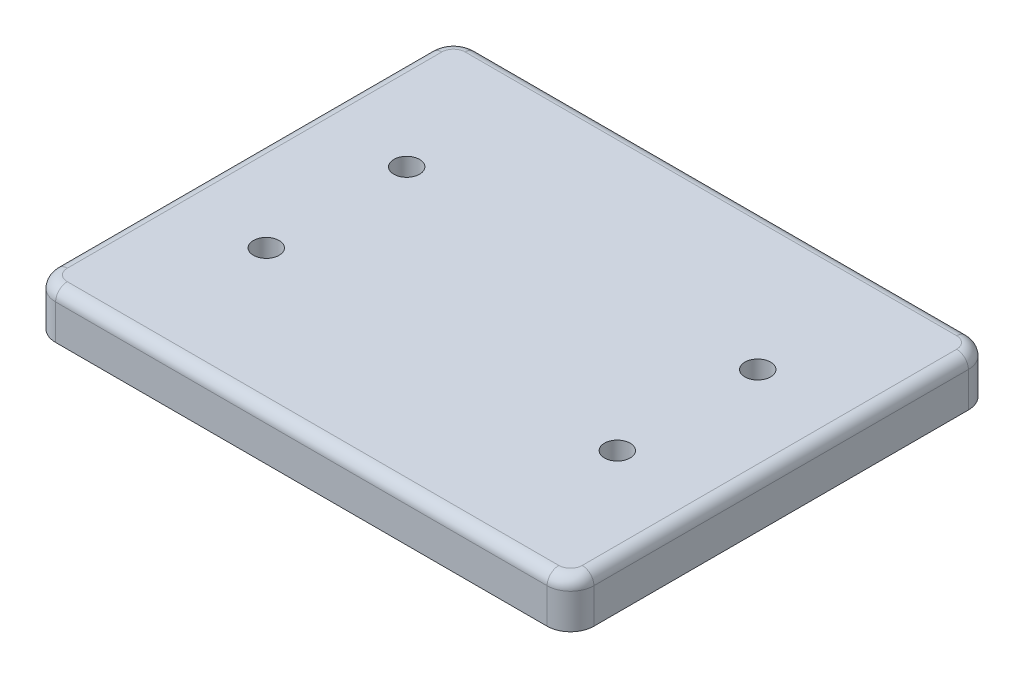
ISO-10303-21;
HEADER;
FILE_DESCRIPTION(('STEP AP214'),'2;1');
FILE_NAME('part.step','',(''),(''),'','','');
FILE_SCHEMA(('AUTOMOTIVE_DESIGN { 1 0 10303 214 1 1 1 1 }'));
ENDSEC;
DATA;
#1=APPLICATION_CONTEXT('core data for automotive mechanical design processes');
#2=APPLICATION_PROTOCOL_DEFINITION('international standard','automotive_design',2000,#1);
#3=PRODUCT_CONTEXT('',#1,'mechanical');
#4=PRODUCT('Part','Part','',(#3));
#5=PRODUCT_RELATED_PRODUCT_CATEGORY('part','',(#4));
#6=PRODUCT_DEFINITION_FORMATION('','',#4);
#7=PRODUCT_DEFINITION_CONTEXT('part definition',#1,'design');
#8=PRODUCT_DEFINITION('design','',#6,#7);
#9=PRODUCT_DEFINITION_SHAPE('','',#8);
#10=(LENGTH_UNIT() NAMED_UNIT(*) SI_UNIT(.MILLI.,.METRE.));
#11=(NAMED_UNIT(*) PLANE_ANGLE_UNIT() SI_UNIT($,.RADIAN.));
#12=(NAMED_UNIT(*) SI_UNIT($,.STERADIAN.) SOLID_ANGLE_UNIT());
#13=UNCERTAINTY_MEASURE_WITH_UNIT(LENGTH_MEASURE(1.E-05),#10,'distance_accuracy_value','');
#14=(GEOMETRIC_REPRESENTATION_CONTEXT(3) GLOBAL_UNCERTAINTY_ASSIGNED_CONTEXT((#13)) GLOBAL_UNIT_ASSIGNED_CONTEXT((#10,
#11,#12)) REPRESENTATION_CONTEXT('',''));
#15=CARTESIAN_POINT('',(0.,0.,0.));
#16=DIRECTION('',(0.,0.,1.));
#17=DIRECTION('',(1.,0.,0.));
#18=AXIS2_PLACEMENT_3D('',#15,#16,#17);
#19=CARTESIAN_POINT('',(-150.,40.,-60.));
#20=DIRECTION('',(0.,-1.,0.));
#21=DIRECTION('',(0.,0.,-1.));
#22=AXIS2_PLACEMENT_3D('',#19,#20,#21);
#23=CYLINDRICAL_SURFACE('',#22,11.);
#24=CARTESIAN_POINT('',(-150.,40.,-60.));
#25=DIRECTION('',(0.,1.,0.));
#26=DIRECTION('',(0.,0.,1.));
#27=AXIS2_PLACEMENT_3D('',#24,#25,#26);
#28=CIRCLE('',#27,11.);
#29=CARTESIAN_POINT('',(-150.,40.,-49.));
#30=VERTEX_POINT('',#29);
#31=EDGE_CURVE('E154',#30,#30,#28,.T.);
#32=ORIENTED_EDGE('',*,*,#31,.T.);
#33=EDGE_LOOP('',(#32));
#34=FACE_BOUND('',#33,.T.);
#35=CARTESIAN_POINT('',(-150.,20.,-60.));
#36=DIRECTION('',(0.,-1.,0.));
#37=DIRECTION('',(0.,0.,-1.));
#38=AXIS2_PLACEMENT_3D('',#35,#36,#37);
#39=CIRCLE('',#38,11.);
#40=CARTESIAN_POINT('',(-150.,20.,-71.));
#41=VERTEX_POINT('',#40);
#42=EDGE_CURVE('E42',#41,#41,#39,.T.);
#43=ORIENTED_EDGE('',*,*,#42,.T.);
#44=EDGE_LOOP('',(#43));
#45=FACE_BOUND('',#44,.T.);
#46=ADVANCED_FACE('F38',(#34,#45),#23,.F.);
#47=CARTESIAN_POINT('',(150.,40.,60.));
#48=DIRECTION('',(0.,-1.,0.));
#49=DIRECTION('',(0.,0.,-1.));
#50=AXIS2_PLACEMENT_3D('',#47,#48,#49);
#51=CYLINDRICAL_SURFACE('',#50,11.);
#52=CARTESIAN_POINT('',(150.,40.,60.));
#53=DIRECTION('',(0.,1.,0.));
#54=DIRECTION('',(0.,0.,1.));
#55=AXIS2_PLACEMENT_3D('',#52,#53,#54);
#56=CIRCLE('',#55,11.);
#57=CARTESIAN_POINT('',(150.,40.,71.));
#58=VERTEX_POINT('',#57);
#59=EDGE_CURVE('E264',#58,#58,#56,.T.);
#60=ORIENTED_EDGE('',*,*,#59,.T.);
#61=EDGE_LOOP('',(#60));
#62=FACE_BOUND('',#61,.T.);
#63=CARTESIAN_POINT('',(150.,20.,60.));
#64=DIRECTION('',(0.,-1.,0.));
#65=DIRECTION('',(0.,0.,-1.));
#66=AXIS2_PLACEMENT_3D('',#63,#64,#65);
#67=CIRCLE('',#66,11.);
#68=CARTESIAN_POINT('',(150.,20.,49.));
#69=VERTEX_POINT('',#68);
#70=EDGE_CURVE('E245',#69,#69,#67,.T.);
#71=ORIENTED_EDGE('',*,*,#70,.T.);
#72=EDGE_LOOP('',(#71));
#73=FACE_BOUND('',#72,.T.);
#74=ADVANCED_FACE('F284',(#62,#73),#51,.F.);
#75=CARTESIAN_POINT('',(150.,40.,-60.));
#76=DIRECTION('',(0.,-1.,0.));
#77=DIRECTION('',(0.,0.,-1.));
#78=AXIS2_PLACEMENT_3D('',#75,#76,#77);
#79=CYLINDRICAL_SURFACE('',#78,11.);
#80=CARTESIAN_POINT('',(150.,40.,-60.));
#81=DIRECTION('',(0.,1.,0.));
#82=DIRECTION('',(0.,0.,-1.));
#83=AXIS2_PLACEMENT_3D('',#80,#81,#82);
#84=CIRCLE('',#83,11.);
#85=CARTESIAN_POINT('',(150.,40.,-71.));
#86=VERTEX_POINT('',#85);
#87=EDGE_CURVE('E239',#86,#86,#84,.T.);
#88=ORIENTED_EDGE('',*,*,#87,.T.);
#89=EDGE_LOOP('',(#88));
#90=FACE_BOUND('',#89,.T.);
#91=CARTESIAN_POINT('',(150.,20.,-60.));
#92=DIRECTION('',(0.,-1.,0.));
#93=DIRECTION('',(0.,0.,-1.));
#94=AXIS2_PLACEMENT_3D('',#91,#92,#93);
#95=CIRCLE('',#94,11.);
#96=CARTESIAN_POINT('',(150.,20.,-71.));
#97=VERTEX_POINT('',#96);
#98=EDGE_CURVE('E243',#97,#97,#95,.T.);
#99=ORIENTED_EDGE('',*,*,#98,.T.);
#100=EDGE_LOOP('',(#99));
#101=FACE_BOUND('',#100,.T.);
#102=ADVANCED_FACE('F281',(#90,#101),#79,.F.);
#103=CARTESIAN_POINT('',(-150.,40.,60.));
#104=DIRECTION('',(0.,-1.,0.));
#105=DIRECTION('',(0.,0.,-1.));
#106=AXIS2_PLACEMENT_3D('',#103,#104,#105);
#107=CYLINDRICAL_SURFACE('',#106,11.);
#108=CARTESIAN_POINT('',(-150.,40.,60.));
#109=DIRECTION('',(0.,1.,0.));
#110=DIRECTION('',(0.,0.,-1.));
#111=AXIS2_PLACEMENT_3D('',#108,#109,#110);
#112=CIRCLE('',#111,11.);
#113=CARTESIAN_POINT('',(-150.,40.,49.));
#114=VERTEX_POINT('',#113);
#115=EDGE_CURVE('E157',#114,#114,#112,.T.);
#116=ORIENTED_EDGE('',*,*,#115,.T.);
#117=EDGE_LOOP('',(#116));
#118=FACE_BOUND('',#117,.T.);
#119=CARTESIAN_POINT('',(-150.,20.,60.));
#120=DIRECTION('',(0.,-1.,0.));
#121=DIRECTION('',(0.,0.,-1.));
#122=AXIS2_PLACEMENT_3D('',#119,#120,#121);
#123=CIRCLE('',#122,11.);
#124=CARTESIAN_POINT('',(-150.,20.,49.));
#125=VERTEX_POINT('',#124);
#126=EDGE_CURVE('E219',#125,#125,#123,.T.);
#127=ORIENTED_EDGE('',*,*,#126,.T.);
#128=EDGE_LOOP('',(#127));
#129=FACE_BOUND('',#128,.T.);
#130=ADVANCED_FACE('F269',(#118,#129),#107,.F.);
#131=CARTESIAN_POINT('',(-210.,40.,160.));
#132=DIRECTION('',(0.,-1.,0.));
#133=DIRECTION('',(0.,0.,-1.));
#134=AXIS2_PLACEMENT_3D('',#131,#132,#133);
#135=PLANE('',#134);
#136=DIRECTION('',(0.,0.,1.));
#137=VECTOR('',#136,1.);
#138=CARTESIAN_POINT('',(-220.,40.,160.));
#139=LINE('',#138,#137);
#140=CARTESIAN_POINT('',(-220.,40.,-160.));
#141=VERTEX_POINT('',#140);
#142=CARTESIAN_POINT('',(-220.,40.,160.));
#143=VERTEX_POINT('',#142);
#144=EDGE_CURVE('E199',#141,#143,#139,.T.);
#145=ORIENTED_EDGE('',*,*,#144,.T.);
#146=CARTESIAN_POINT('',(-210.,40.,160.));
#147=DIRECTION('',(0.,-1.,0.));
#148=DIRECTION('',(0.,0.,-1.));
#149=AXIS2_PLACEMENT_3D('',#146,#147,#148);
#150=CIRCLE('',#149,9.99999999999999);
#151=CARTESIAN_POINT('',(-210.,40.,170.));
#152=VERTEX_POINT('',#151);
#153=EDGE_CURVE('E201',#143,#152,#150,.F.);
#154=ORIENTED_EDGE('',*,*,#153,.T.);
#155=DIRECTION('',(1.,0.,0.));
#156=VECTOR('',#155,1.);
#157=CARTESIAN_POINT('',(-210.,40.,170.));
#158=LINE('',#157,#156);
#159=CARTESIAN_POINT('',(210.,40.,170.));
#160=VERTEX_POINT('',#159);
#161=EDGE_CURVE('E138',#152,#160,#158,.T.);
#162=ORIENTED_EDGE('',*,*,#161,.T.);
#163=CARTESIAN_POINT('',(210.,40.,160.));
#164=DIRECTION('',(0.,-1.,0.));
#165=DIRECTION('',(0.,0.,-1.));
#166=AXIS2_PLACEMENT_3D('',#163,#164,#165);
#167=CIRCLE('',#166,9.99999999999999);
#168=CARTESIAN_POINT('',(220.,40.,160.));
#169=VERTEX_POINT('',#168);
#170=EDGE_CURVE('E189',#160,#169,#167,.F.);
#171=ORIENTED_EDGE('',*,*,#170,.T.);
#172=DIRECTION('',(0.,0.,-1.));
#173=VECTOR('',#172,1.);
#174=CARTESIAN_POINT('',(220.,40.,160.));
#175=LINE('',#174,#173);
#176=CARTESIAN_POINT('',(220.,40.,-160.));
#177=VERTEX_POINT('',#176);
#178=EDGE_CURVE('E191',#169,#177,#175,.T.);
#179=ORIENTED_EDGE('',*,*,#178,.T.);
#180=CARTESIAN_POINT('',(210.,40.,-160.));
#181=DIRECTION('',(0.,-1.,0.));
#182=DIRECTION('',(0.,0.,-1.));
#183=AXIS2_PLACEMENT_3D('',#180,#181,#182);
#184=CIRCLE('',#183,9.99999999999999);
#185=CARTESIAN_POINT('',(210.,40.,-170.));
#186=VERTEX_POINT('',#185);
#187=EDGE_CURVE('E193',#177,#186,#184,.F.);
#188=ORIENTED_EDGE('',*,*,#187,.T.);
#189=DIRECTION('',(-1.,0.,0.));
#190=VECTOR('',#189,1.);
#191=CARTESIAN_POINT('',(-210.,40.,-170.));
#192=LINE('',#191,#190);
#193=CARTESIAN_POINT('',(-210.,40.,-170.));
#194=VERTEX_POINT('',#193);
#195=EDGE_CURVE('E195',#186,#194,#192,.T.);
#196=ORIENTED_EDGE('',*,*,#195,.T.);
#197=CARTESIAN_POINT('',(-210.,40.,-160.));
#198=DIRECTION('',(0.,-1.,0.));
#199=DIRECTION('',(0.,0.,-1.));
#200=AXIS2_PLACEMENT_3D('',#197,#198,#199);
#201=CIRCLE('',#200,9.99999999999999);
#202=EDGE_CURVE('E197',#194,#141,#201,.F.);
#203=ORIENTED_EDGE('',*,*,#202,.T.);
#204=EDGE_LOOP('',(#145,#154,#162,#171,#179,#188,#196,#203));
#205=FACE_BOUND('',#204,.T.);
#206=ORIENTED_EDGE('',*,*,#31,.F.);
#207=EDGE_LOOP('',(#206));
#208=FACE_BOUND('',#207,.T.);
#209=ORIENTED_EDGE('',*,*,#115,.F.);
#210=EDGE_LOOP('',(#209));
#211=FACE_BOUND('',#210,.T.);
#212=ORIENTED_EDGE('',*,*,#59,.F.);
#213=EDGE_LOOP('',(#212));
#214=FACE_BOUND('',#213,.T.);
#215=ORIENTED_EDGE('',*,*,#87,.F.);
#216=EDGE_LOOP('',(#215));
#217=FACE_BOUND('',#216,.T.);
#218=ADVANCED_FACE('F272',(#205,#208,#211,#214,#217),#135,.F.);
#219=CARTESIAN_POINT('',(-210.,0.,160.));
#220=DIRECTION('',(0.,-1.,0.));
#221=DIRECTION('',(0.,0.,-1.));
#222=AXIS2_PLACEMENT_3D('',#219,#220,#221);
#223=PLANE('',#222);
#224=CARTESIAN_POINT('',(-150.,0.,-60.));
#225=DIRECTION('',(0.,-1.,0.));
#226=DIRECTION('',(0.,0.,-1.));
#227=AXIS2_PLACEMENT_3D('',#224,#225,#226);
#228=CIRCLE('',#227,18.);
#229=CARTESIAN_POINT('',(-150.,0.,-78.));
#230=VERTEX_POINT('',#229);
#231=EDGE_CURVE('E308',#230,#230,#228,.T.);
#232=ORIENTED_EDGE('',*,*,#231,.F.);
#233=EDGE_LOOP('',(#232));
#234=FACE_BOUND('',#233,.T.);
#235=CARTESIAN_POINT('',(150.,0.,60.));
#236=DIRECTION('',(0.,-1.,0.));
#237=DIRECTION('',(0.,0.,-1.));
#238=AXIS2_PLACEMENT_3D('',#235,#236,#237);
#239=CIRCLE('',#238,18.);
#240=CARTESIAN_POINT('',(150.,0.,42.));
#241=VERTEX_POINT('',#240);
#242=EDGE_CURVE('E298',#241,#241,#239,.T.);
#243=ORIENTED_EDGE('',*,*,#242,.F.);
#244=EDGE_LOOP('',(#243));
#245=FACE_BOUND('',#244,.T.);
#246=CARTESIAN_POINT('',(150.,0.,-60.));
#247=DIRECTION('',(0.,-1.,0.));
#248=DIRECTION('',(0.,0.,-1.));
#249=AXIS2_PLACEMENT_3D('',#246,#247,#248);
#250=CIRCLE('',#249,18.);
#251=CARTESIAN_POINT('',(150.,0.,-78.));
#252=VERTEX_POINT('',#251);
#253=EDGE_CURVE('E299',#252,#252,#250,.T.);
#254=ORIENTED_EDGE('',*,*,#253,.F.);
#255=EDGE_LOOP('',(#254));
#256=FACE_BOUND('',#255,.T.);
#257=CARTESIAN_POINT('',(-150.,0.,60.));
#258=DIRECTION('',(0.,-1.,0.));
#259=DIRECTION('',(0.,0.,-1.));
#260=AXIS2_PLACEMENT_3D('',#257,#258,#259);
#261=CIRCLE('',#260,18.);
#262=CARTESIAN_POINT('',(-150.,0.,42.));
#263=VERTEX_POINT('',#262);
#264=EDGE_CURVE('E251',#263,#263,#261,.T.);
#265=ORIENTED_EDGE('',*,*,#264,.F.);
#266=EDGE_LOOP('',(#265));
#267=FACE_BOUND('',#266,.T.);
#268=CARTESIAN_POINT('',(-210.,0.,160.));
#269=DIRECTION('',(0.,1.,0.));
#270=DIRECTION('',(0.,0.,-1.));
#271=AXIS2_PLACEMENT_3D('',#268,#269,#270);
#272=CIRCLE('',#271,20.);
#273=CARTESIAN_POINT('',(-230.,0.,160.));
#274=VERTEX_POINT('',#273);
#275=CARTESIAN_POINT('',(-210.,0.,180.));
#276=VERTEX_POINT('',#275);
#277=EDGE_CURVE('E145',#274,#276,#272,.T.);
#278=ORIENTED_EDGE('',*,*,#277,.F.);
#279=DIRECTION('',(0.,0.,1.));
#280=VECTOR('',#279,1.);
#281=CARTESIAN_POINT('',(-230.,0.,160.));
#282=LINE('',#281,#280);
#283=CARTESIAN_POINT('',(-230.,0.,-160.));
#284=VERTEX_POINT('',#283);
#285=EDGE_CURVE('E174',#284,#274,#282,.T.);
#286=ORIENTED_EDGE('',*,*,#285,.F.);
#287=CARTESIAN_POINT('',(-210.,0.,-160.));
#288=DIRECTION('',(0.,1.,0.));
#289=DIRECTION('',(0.,0.,-1.));
#290=AXIS2_PLACEMENT_3D('',#287,#288,#289);
#291=CIRCLE('',#290,20.);
#292=CARTESIAN_POINT('',(-210.,0.,-180.));
#293=VERTEX_POINT('',#292);
#294=EDGE_CURVE('E171',#293,#284,#291,.T.);
#295=ORIENTED_EDGE('',*,*,#294,.F.);
#296=DIRECTION('',(-1.,0.,0.));
#297=VECTOR('',#296,1.);
#298=CARTESIAN_POINT('',(-210.,0.,-180.));
#299=LINE('',#298,#297);
#300=CARTESIAN_POINT('',(210.,0.,-180.));
#301=VERTEX_POINT('',#300);
#302=EDGE_CURVE('E168',#301,#293,#299,.T.);
#303=ORIENTED_EDGE('',*,*,#302,.F.);
#304=CARTESIAN_POINT('',(210.,0.,-160.));
#305=DIRECTION('',(0.,1.,0.));
#306=DIRECTION('',(0.,0.,-1.));
#307=AXIS2_PLACEMENT_3D('',#304,#305,#306);
#308=CIRCLE('',#307,20.);
#309=CARTESIAN_POINT('',(230.,0.,-160.));
#310=VERTEX_POINT('',#309);
#311=EDGE_CURVE('E165',#310,#301,#308,.T.);
#312=ORIENTED_EDGE('',*,*,#311,.F.);
#313=DIRECTION('',(0.,0.,-1.));
#314=VECTOR('',#313,1.);
#315=CARTESIAN_POINT('',(230.,0.,160.));
#316=LINE('',#315,#314);
#317=CARTESIAN_POINT('',(230.,0.,160.));
#318=VERTEX_POINT('',#317);
#319=EDGE_CURVE('E162',#318,#310,#316,.T.);
#320=ORIENTED_EDGE('',*,*,#319,.F.);
#321=CARTESIAN_POINT('',(210.,0.,160.));
#322=DIRECTION('',(0.,1.,0.));
#323=DIRECTION('',(0.,0.,1.));
#324=AXIS2_PLACEMENT_3D('',#321,#322,#323);
#325=CIRCLE('',#324,20.);
#326=CARTESIAN_POINT('',(210.,0.,180.));
#327=VERTEX_POINT('',#326);
#328=EDGE_CURVE('E148',#327,#318,#325,.T.);
#329=ORIENTED_EDGE('',*,*,#328,.F.);
#330=DIRECTION('',(1.,0.,0.));
#331=VECTOR('',#330,1.);
#332=CARTESIAN_POINT('',(-210.,0.,180.));
#333=LINE('',#332,#331);
#334=EDGE_CURVE('E131',#276,#327,#333,.T.);
#335=ORIENTED_EDGE('',*,*,#334,.F.);
#336=EDGE_LOOP('',(#278,#286,#295,#303,#312,#320,#329,#335));
#337=FACE_BOUND('',#336,.T.);
#338=ADVANCED_FACE('F143',(#234,#245,#256,#267,#337),#223,.T.);
#339=CARTESIAN_POINT('',(-210.,40.,160.));
#340=DIRECTION('',(0.,-1.,0.));
#341=DIRECTION('',(0.,0.,-1.));
#342=AXIS2_PLACEMENT_3D('',#339,#340,#341);
#343=CYLINDRICAL_SURFACE('',#342,20.);
#344=DIRECTION('',(0.,-1.,0.));
#345=VECTOR('',#344,1.);
#346=CARTESIAN_POINT('',(-210.,40.,180.));
#347=LINE('',#346,#345);
#348=CARTESIAN_POINT('',(-210.,30.,180.));
#349=VERTEX_POINT('',#348);
#350=EDGE_CURVE('E128',#349,#276,#347,.T.);
#351=ORIENTED_EDGE('',*,*,#350,.F.);
#352=CARTESIAN_POINT('',(-210.,30.,160.));
#353=DIRECTION('',(0.,-1.,0.));
#354=DIRECTION('',(0.,0.,-1.));
#355=AXIS2_PLACEMENT_3D('',#352,#353,#354);
#356=CIRCLE('',#355,20.);
#357=CARTESIAN_POINT('',(-230.,30.,160.));
#358=VERTEX_POINT('',#357);
#359=EDGE_CURVE('E204',#349,#358,#356,.T.);
#360=ORIENTED_EDGE('',*,*,#359,.T.);
#361=DIRECTION('',(0.,-1.,0.));
#362=VECTOR('',#361,1.);
#363=CARTESIAN_POINT('',(-230.,40.,160.));
#364=LINE('',#363,#362);
#365=EDGE_CURVE('E152',#358,#274,#364,.T.);
#366=ORIENTED_EDGE('',*,*,#365,.T.);
#367=ORIENTED_EDGE('',*,*,#277,.T.);
#368=EDGE_LOOP('',(#351,#360,#366,#367));
#369=FACE_BOUND('',#368,.T.);
#370=ADVANCED_FACE('F150',(#369),#343,.T.);
#371=CARTESIAN_POINT('',(-210.,40.,180.));
#372=DIRECTION('',(0.,0.,-1.));
#373=DIRECTION('',(-1.,0.,0.));
#374=AXIS2_PLACEMENT_3D('',#371,#372,#373);
#375=PLANE('',#374);
#376=DIRECTION('',(0.,-1.,0.));
#377=VECTOR('',#376,1.);
#378=CARTESIAN_POINT('',(210.,40.,180.));
#379=LINE('',#378,#377);
#380=CARTESIAN_POINT('',(210.,30.,180.));
#381=VERTEX_POINT('',#380);
#382=EDGE_CURVE('E139',#381,#327,#379,.T.);
#383=ORIENTED_EDGE('',*,*,#382,.F.);
#384=DIRECTION('',(1.,0.,0.));
#385=VECTOR('',#384,1.);
#386=CARTESIAN_POINT('',(-210.,30.,180.));
#387=LINE('',#386,#385);
#388=EDGE_CURVE('E11',#381,#349,#387,.F.);
#389=ORIENTED_EDGE('',*,*,#388,.T.);
#390=ORIENTED_EDGE('',*,*,#350,.T.);
#391=ORIENTED_EDGE('',*,*,#334,.T.);
#392=EDGE_LOOP('',(#383,#389,#390,#391));
#393=FACE_BOUND('',#392,.T.);
#394=ADVANCED_FACE('F130',(#393),#375,.F.);
#395=CARTESIAN_POINT('',(210.,40.,160.));
#396=DIRECTION('',(0.,-1.,0.));
#397=DIRECTION('',(0.,0.,-1.));
#398=AXIS2_PLACEMENT_3D('',#395,#396,#397);
#399=CYLINDRICAL_SURFACE('',#398,20.);
#400=DIRECTION('',(0.,-1.,0.));
#401=VECTOR('',#400,1.);
#402=CARTESIAN_POINT('',(230.,40.,160.));
#403=LINE('',#402,#401);
#404=CARTESIAN_POINT('',(230.,30.,160.));
#405=VERTEX_POINT('',#404);
#406=EDGE_CURVE('E185',#405,#318,#403,.T.);
#407=ORIENTED_EDGE('',*,*,#406,.F.);
#408=CARTESIAN_POINT('',(210.,30.,160.));
#409=DIRECTION('',(0.,-1.,0.));
#410=DIRECTION('',(0.,0.,-1.));
#411=AXIS2_PLACEMENT_3D('',#408,#409,#410);
#412=CIRCLE('',#411,20.);
#413=EDGE_CURVE('E47',#405,#381,#412,.T.);
#414=ORIENTED_EDGE('',*,*,#413,.T.);
#415=ORIENTED_EDGE('',*,*,#382,.T.);
#416=ORIENTED_EDGE('',*,*,#328,.T.);
#417=EDGE_LOOP('',(#407,#414,#415,#416));
#418=FACE_BOUND('',#417,.T.);
#419=ADVANCED_FACE('F369',(#418),#399,.T.);
#420=CARTESIAN_POINT('',(230.,40.,160.));
#421=DIRECTION('',(-1.,0.,0.));
#422=DIRECTION('',(0.,0.,1.));
#423=AXIS2_PLACEMENT_3D('',#420,#421,#422);
#424=PLANE('',#423);
#425=DIRECTION('',(0.,-1.,0.));
#426=VECTOR('',#425,1.);
#427=CARTESIAN_POINT('',(230.,40.,-160.));
#428=LINE('',#427,#426);
#429=CARTESIAN_POINT('',(230.,30.,-160.));
#430=VERTEX_POINT('',#429);
#431=EDGE_CURVE('E183',#430,#310,#428,.T.);
#432=ORIENTED_EDGE('',*,*,#431,.F.);
#433=DIRECTION('',(0.,0.,-1.));
#434=VECTOR('',#433,1.);
#435=CARTESIAN_POINT('',(230.,30.,160.));
#436=LINE('',#435,#434);
#437=EDGE_CURVE('E62',#430,#405,#436,.F.);
#438=ORIENTED_EDGE('',*,*,#437,.T.);
#439=ORIENTED_EDGE('',*,*,#406,.T.);
#440=ORIENTED_EDGE('',*,*,#319,.T.);
#441=EDGE_LOOP('',(#432,#438,#439,#440));
#442=FACE_BOUND('',#441,.T.);
#443=ADVANCED_FACE('F365',(#442),#424,.F.);
#444=CARTESIAN_POINT('',(210.,40.,-160.));
#445=DIRECTION('',(0.,-1.,0.));
#446=DIRECTION('',(0.,0.,-1.));
#447=AXIS2_PLACEMENT_3D('',#444,#445,#446);
#448=CYLINDRICAL_SURFACE('',#447,20.);
#449=DIRECTION('',(0.,-1.,0.));
#450=VECTOR('',#449,1.);
#451=CARTESIAN_POINT('',(210.,40.,-180.));
#452=LINE('',#451,#450);
#453=CARTESIAN_POINT('',(210.,30.,-180.));
#454=VERTEX_POINT('',#453);
#455=EDGE_CURVE('E181',#454,#301,#452,.T.);
#456=ORIENTED_EDGE('',*,*,#455,.F.);
#457=CARTESIAN_POINT('',(210.,30.,-160.));
#458=DIRECTION('',(0.,-1.,0.));
#459=DIRECTION('',(0.,0.,-1.));
#460=AXIS2_PLACEMENT_3D('',#457,#458,#459);
#461=CIRCLE('',#460,20.);
#462=EDGE_CURVE('E212',#454,#430,#461,.T.);
#463=ORIENTED_EDGE('',*,*,#462,.T.);
#464=ORIENTED_EDGE('',*,*,#431,.T.);
#465=ORIENTED_EDGE('',*,*,#311,.T.);
#466=EDGE_LOOP('',(#456,#463,#464,#465));
#467=FACE_BOUND('',#466,.T.);
#468=ADVANCED_FACE('F361',(#467),#448,.T.);
#469=CARTESIAN_POINT('',(-210.,40.,-180.));
#470=DIRECTION('',(0.,0.,1.));
#471=DIRECTION('',(1.,0.,0.));
#472=AXIS2_PLACEMENT_3D('',#469,#470,#471);
#473=PLANE('',#472);
#474=DIRECTION('',(0.,-1.,0.));
#475=VECTOR('',#474,1.);
#476=CARTESIAN_POINT('',(-210.,40.,-180.));
#477=LINE('',#476,#475);
#478=CARTESIAN_POINT('',(-210.,30.,-180.));
#479=VERTEX_POINT('',#478);
#480=EDGE_CURVE('E179',#479,#293,#477,.T.);
#481=ORIENTED_EDGE('',*,*,#480,.F.);
#482=DIRECTION('',(-1.,0.,0.));
#483=VECTOR('',#482,1.);
#484=CARTESIAN_POINT('',(-210.,30.,-180.));
#485=LINE('',#484,#483);
#486=EDGE_CURVE('E210',#479,#454,#485,.F.);
#487=ORIENTED_EDGE('',*,*,#486,.T.);
#488=ORIENTED_EDGE('',*,*,#455,.T.);
#489=ORIENTED_EDGE('',*,*,#302,.T.);
#490=EDGE_LOOP('',(#481,#487,#488,#489));
#491=FACE_BOUND('',#490,.T.);
#492=ADVANCED_FACE('F357',(#491),#473,.F.);
#493=CARTESIAN_POINT('',(-210.,40.,-160.));
#494=DIRECTION('',(0.,-1.,0.));
#495=DIRECTION('',(0.,0.,-1.));
#496=AXIS2_PLACEMENT_3D('',#493,#494,#495);
#497=CYLINDRICAL_SURFACE('',#496,20.);
#498=DIRECTION('',(0.,-1.,0.));
#499=VECTOR('',#498,1.);
#500=CARTESIAN_POINT('',(-230.,40.,-160.));
#501=LINE('',#500,#499);
#502=CARTESIAN_POINT('',(-230.,30.,-160.));
#503=VERTEX_POINT('',#502);
#504=EDGE_CURVE('E177',#503,#284,#501,.T.);
#505=ORIENTED_EDGE('',*,*,#504,.F.);
#506=CARTESIAN_POINT('',(-210.,30.,-160.));
#507=DIRECTION('',(0.,-1.,0.));
#508=DIRECTION('',(0.,0.,-1.));
#509=AXIS2_PLACEMENT_3D('',#506,#507,#508);
#510=CIRCLE('',#509,20.);
#511=EDGE_CURVE('E208',#503,#479,#510,.T.);
#512=ORIENTED_EDGE('',*,*,#511,.T.);
#513=ORIENTED_EDGE('',*,*,#480,.T.);
#514=ORIENTED_EDGE('',*,*,#294,.T.);
#515=EDGE_LOOP('',(#505,#512,#513,#514));
#516=FACE_BOUND('',#515,.T.);
#517=ADVANCED_FACE('F353',(#516),#497,.T.);
#518=CARTESIAN_POINT('',(-230.,40.,160.));
#519=DIRECTION('',(1.,0.,0.));
#520=DIRECTION('',(0.,0.,-1.));
#521=AXIS2_PLACEMENT_3D('',#518,#519,#520);
#522=PLANE('',#521);
#523=ORIENTED_EDGE('',*,*,#365,.F.);
#524=DIRECTION('',(0.,0.,1.));
#525=VECTOR('',#524,1.);
#526=CARTESIAN_POINT('',(-230.,30.,160.));
#527=LINE('',#526,#525);
#528=EDGE_CURVE('E206',#358,#503,#527,.F.);
#529=ORIENTED_EDGE('',*,*,#528,.T.);
#530=ORIENTED_EDGE('',*,*,#504,.T.);
#531=ORIENTED_EDGE('',*,*,#285,.T.);
#532=EDGE_LOOP('',(#523,#529,#530,#531));
#533=FACE_BOUND('',#532,.T.);
#534=ADVANCED_FACE('F350',(#533),#522,.F.);
#535=CARTESIAN_POINT('',(210.,30.,-160.));
#536=DIRECTION('',(0.,-1.,0.));
#537=DIRECTION('',(0.,0.,-1.));
#538=AXIS2_PLACEMENT_3D('',#535,#536,#537);
#539=DEGENERATE_TOROIDAL_SURFACE('',#538,9.99999999999999,10.,.T.);
#540=CARTESIAN_POINT('',(220.,30.,-160.));
#541=DIRECTION('',(0.,0.,1.));
#542=DIRECTION('',(1.,0.,0.));
#543=AXIS2_PLACEMENT_3D('',#540,#541,#542);
#544=CIRCLE('',#543,10.);
#545=EDGE_CURVE('E233',#430,#177,#544,.T.);
#546=ORIENTED_EDGE('',*,*,#545,.F.);
#547=ORIENTED_EDGE('',*,*,#462,.F.);
#548=CARTESIAN_POINT('',(210.,30.,-170.));
#549=DIRECTION('',(-1.,0.,0.));
#550=DIRECTION('',(0.,0.,1.));
#551=AXIS2_PLACEMENT_3D('',#548,#549,#550);
#552=CIRCLE('',#551,10.);
#553=EDGE_CURVE('E236',#186,#454,#552,.T.);
#554=ORIENTED_EDGE('',*,*,#553,.F.);
#555=ORIENTED_EDGE('',*,*,#187,.F.);
#556=EDGE_LOOP('',(#546,#547,#554,#555));
#557=FACE_BOUND('',#556,.T.);
#558=ADVANCED_FACE('F40',(#557),#539,.T.);
#559=CARTESIAN_POINT('',(-210.,30.,-170.));
#560=DIRECTION('',(-1.,0.,0.));
#561=DIRECTION('',(0.,0.,1.));
#562=AXIS2_PLACEMENT_3D('',#559,#560,#561);
#563=CYLINDRICAL_SURFACE('',#562,10.);
#564=ORIENTED_EDGE('',*,*,#553,.T.);
#565=ORIENTED_EDGE('',*,*,#486,.F.);
#566=CARTESIAN_POINT('',(-210.,30.,-170.));
#567=DIRECTION('',(-1.,0.,0.));
#568=DIRECTION('',(0.,0.,1.));
#569=AXIS2_PLACEMENT_3D('',#566,#567,#568);
#570=CIRCLE('',#569,10.);
#571=EDGE_CURVE('E230',#194,#479,#570,.T.);
#572=ORIENTED_EDGE('',*,*,#571,.F.);
#573=ORIENTED_EDGE('',*,*,#195,.F.);
#574=EDGE_LOOP('',(#564,#565,#572,#573));
#575=FACE_BOUND('',#574,.T.);
#576=ADVANCED_FACE('F398',(#575),#563,.T.);
#577=CARTESIAN_POINT('',(220.,30.,160.));
#578=DIRECTION('',(0.,0.,-1.));
#579=DIRECTION('',(-1.,0.,0.));
#580=AXIS2_PLACEMENT_3D('',#577,#578,#579);
#581=CYLINDRICAL_SURFACE('',#580,10.);
#582=ORIENTED_EDGE('',*,*,#545,.T.);
#583=ORIENTED_EDGE('',*,*,#178,.F.);
#584=CARTESIAN_POINT('',(220.,30.,160.));
#585=DIRECTION('',(0.,0.,1.));
#586=DIRECTION('',(1.,0.,0.));
#587=AXIS2_PLACEMENT_3D('',#584,#585,#586);
#588=CIRCLE('',#587,10.);
#589=EDGE_CURVE('E227',#405,#169,#588,.T.);
#590=ORIENTED_EDGE('',*,*,#589,.F.);
#591=ORIENTED_EDGE('',*,*,#437,.F.);
#592=EDGE_LOOP('',(#582,#583,#590,#591));
#593=FACE_BOUND('',#592,.T.);
#594=ADVANCED_FACE('F395',(#593),#581,.T.);
#595=CARTESIAN_POINT('',(-210.,30.,-160.));
#596=DIRECTION('',(0.,-1.,0.));
#597=DIRECTION('',(0.,0.,-1.));
#598=AXIS2_PLACEMENT_3D('',#595,#596,#597);
#599=DEGENERATE_TOROIDAL_SURFACE('',#598,9.99999999999999,10.,.T.);
#600=ORIENTED_EDGE('',*,*,#571,.T.);
#601=ORIENTED_EDGE('',*,*,#511,.F.);
#602=CARTESIAN_POINT('',(-220.,30.,-160.));
#603=DIRECTION('',(0.,0.,1.));
#604=DIRECTION('',(1.,0.,0.));
#605=AXIS2_PLACEMENT_3D('',#602,#603,#604);
#606=CIRCLE('',#605,10.);
#607=EDGE_CURVE('E224',#141,#503,#606,.T.);
#608=ORIENTED_EDGE('',*,*,#607,.F.);
#609=ORIENTED_EDGE('',*,*,#202,.F.);
#610=EDGE_LOOP('',(#600,#601,#608,#609));
#611=FACE_BOUND('',#610,.T.);
#612=ADVANCED_FACE('F391',(#611),#599,.T.);
#613=CARTESIAN_POINT('',(210.,30.,160.));
#614=DIRECTION('',(0.,-1.,0.));
#615=DIRECTION('',(0.,0.,-1.));
#616=AXIS2_PLACEMENT_3D('',#613,#614,#615);
#617=DEGENERATE_TOROIDAL_SURFACE('',#616,9.99999999999999,10.,.T.);
#618=ORIENTED_EDGE('',*,*,#589,.T.);
#619=ORIENTED_EDGE('',*,*,#170,.F.);
#620=CARTESIAN_POINT('',(210.,30.,170.));
#621=DIRECTION('',(-1.,0.,0.));
#622=DIRECTION('',(0.,0.,1.));
#623=AXIS2_PLACEMENT_3D('',#620,#621,#622);
#624=CIRCLE('',#623,10.);
#625=EDGE_CURVE('E221',#381,#160,#624,.T.);
#626=ORIENTED_EDGE('',*,*,#625,.F.);
#627=ORIENTED_EDGE('',*,*,#413,.F.);
#628=EDGE_LOOP('',(#618,#619,#626,#627));
#629=FACE_BOUND('',#628,.T.);
#630=ADVANCED_FACE('F387',(#629),#617,.T.);
#631=CARTESIAN_POINT('',(-220.,30.,160.));
#632=DIRECTION('',(0.,0.,1.));
#633=DIRECTION('',(1.,0.,0.));
#634=AXIS2_PLACEMENT_3D('',#631,#632,#633);
#635=CYLINDRICAL_SURFACE('',#634,10.);
#636=ORIENTED_EDGE('',*,*,#607,.T.);
#637=ORIENTED_EDGE('',*,*,#528,.F.);
#638=CARTESIAN_POINT('',(-220.,30.,160.));
#639=DIRECTION('',(0.,0.,1.));
#640=DIRECTION('',(1.,0.,0.));
#641=AXIS2_PLACEMENT_3D('',#638,#639,#640);
#642=CIRCLE('',#641,10.);
#643=EDGE_CURVE('E218',#143,#358,#642,.T.);
#644=ORIENTED_EDGE('',*,*,#643,.F.);
#645=ORIENTED_EDGE('',*,*,#144,.F.);
#646=EDGE_LOOP('',(#636,#637,#644,#645));
#647=FACE_BOUND('',#646,.T.);
#648=ADVANCED_FACE('F383',(#647),#635,.T.);
#649=CARTESIAN_POINT('',(-210.,30.,170.));
#650=DIRECTION('',(1.,0.,0.));
#651=DIRECTION('',(0.,0.,-1.));
#652=AXIS2_PLACEMENT_3D('',#649,#650,#651);
#653=CYLINDRICAL_SURFACE('',#652,10.);
#654=ORIENTED_EDGE('',*,*,#625,.T.);
#655=ORIENTED_EDGE('',*,*,#161,.F.);
#656=CARTESIAN_POINT('',(-210.,30.,170.));
#657=DIRECTION('',(-1.,0.,0.));
#658=DIRECTION('',(0.,-1.,0.));
#659=AXIS2_PLACEMENT_3D('',#656,#657,#658);
#660=CIRCLE('',#659,10.);
#661=EDGE_CURVE('E216',#349,#152,#660,.T.);
#662=ORIENTED_EDGE('',*,*,#661,.F.);
#663=ORIENTED_EDGE('',*,*,#388,.F.);
#664=EDGE_LOOP('',(#654,#655,#662,#663));
#665=FACE_BOUND('',#664,.T.);
#666=ADVANCED_FACE('F379',(#665),#653,.T.);
#667=CARTESIAN_POINT('',(-210.,30.,160.));
#668=DIRECTION('',(0.,-1.,0.));
#669=DIRECTION('',(0.,0.,-1.));
#670=AXIS2_PLACEMENT_3D('',#667,#668,#669);
#671=DEGENERATE_TOROIDAL_SURFACE('',#670,9.99999999999999,10.,.T.);
#672=ORIENTED_EDGE('',*,*,#643,.T.);
#673=ORIENTED_EDGE('',*,*,#359,.F.);
#674=ORIENTED_EDGE('',*,*,#661,.T.);
#675=ORIENTED_EDGE('',*,*,#153,.F.);
#676=EDGE_LOOP('',(#672,#673,#674,#675));
#677=FACE_BOUND('',#676,.T.);
#678=ADVANCED_FACE('F376',(#677),#671,.T.);
#679=CARTESIAN_POINT('',(-150.,20.,60.));
#680=DIRECTION('',(0.,-1.,0.));
#681=DIRECTION('',(0.,0.,-1.));
#682=AXIS2_PLACEMENT_3D('',#679,#680,#681);
#683=CYLINDRICAL_SURFACE('',#682,18.);
#684=CARTESIAN_POINT('',(-150.,20.,60.));
#685=DIRECTION('',(0.,-1.,0.));
#686=DIRECTION('',(0.,0.,-1.));
#687=AXIS2_PLACEMENT_3D('',#684,#685,#686);
#688=CIRCLE('',#687,18.);
#689=CARTESIAN_POINT('',(-150.,20.,42.));
#690=VERTEX_POINT('',#689);
#691=EDGE_CURVE('E242',#690,#690,#688,.T.);
#692=ORIENTED_EDGE('',*,*,#691,.F.);
#693=EDGE_LOOP('',(#692));
#694=FACE_BOUND('',#693,.T.);
#695=ORIENTED_EDGE('',*,*,#264,.T.);
#696=EDGE_LOOP('',(#695));
#697=FACE_BOUND('',#696,.T.);
#698=ADVANCED_FACE('F337',(#694,#697),#683,.F.);
#699=CARTESIAN_POINT('',(-150.,20.,60.));
#700=DIRECTION('',(0.,-1.,0.));
#701=DIRECTION('',(0.,0.,-1.));
#702=AXIS2_PLACEMENT_3D('',#699,#700,#701);
#703=PLANE('',#702);
#704=ORIENTED_EDGE('',*,*,#126,.F.);
#705=EDGE_LOOP('',(#704));
#706=FACE_BOUND('',#705,.T.);
#707=ORIENTED_EDGE('',*,*,#691,.T.);
#708=EDGE_LOOP('',(#707));
#709=FACE_BOUND('',#708,.T.);
#710=ADVANCED_FACE('F332',(#706,#709),#703,.T.);
#711=CARTESIAN_POINT('',(150.,20.,-60.));
#712=DIRECTION('',(0.,-1.,0.));
#713=DIRECTION('',(0.,0.,-1.));
#714=AXIS2_PLACEMENT_3D('',#711,#712,#713);
#715=CYLINDRICAL_SURFACE('',#714,18.);
#716=CARTESIAN_POINT('',(150.,20.,-60.));
#717=DIRECTION('',(0.,-1.,0.));
#718=DIRECTION('',(0.,0.,-1.));
#719=AXIS2_PLACEMENT_3D('',#716,#717,#718);
#720=CIRCLE('',#719,18.);
#721=CARTESIAN_POINT('',(150.,20.,-78.));
#722=VERTEX_POINT('',#721);
#723=EDGE_CURVE('E296',#722,#722,#720,.T.);
#724=ORIENTED_EDGE('',*,*,#723,.F.);
#725=EDGE_LOOP('',(#724));
#726=FACE_BOUND('',#725,.T.);
#727=ORIENTED_EDGE('',*,*,#253,.T.);
#728=EDGE_LOOP('',(#727));
#729=FACE_BOUND('',#728,.T.);
#730=ADVANCED_FACE('F292',(#726,#729),#715,.F.);
#731=CARTESIAN_POINT('',(150.,20.,-60.));
#732=DIRECTION('',(0.,-1.,0.));
#733=DIRECTION('',(0.,0.,-1.));
#734=AXIS2_PLACEMENT_3D('',#731,#732,#733);
#735=PLANE('',#734);
#736=ORIENTED_EDGE('',*,*,#98,.F.);
#737=EDGE_LOOP('',(#736));
#738=FACE_BOUND('',#737,.T.);
#739=ORIENTED_EDGE('',*,*,#723,.T.);
#740=EDGE_LOOP('',(#739));
#741=FACE_BOUND('',#740,.T.);
#742=ADVANCED_FACE('F288',(#738,#741),#735,.T.);
#743=CARTESIAN_POINT('',(150.,20.,60.));
#744=DIRECTION('',(0.,-1.,0.));
#745=DIRECTION('',(0.,0.,-1.));
#746=AXIS2_PLACEMENT_3D('',#743,#744,#745);
#747=CYLINDRICAL_SURFACE('',#746,18.);
#748=CARTESIAN_POINT('',(150.,20.,60.));
#749=DIRECTION('',(0.,-1.,0.));
#750=DIRECTION('',(0.,0.,-1.));
#751=AXIS2_PLACEMENT_3D('',#748,#749,#750);
#752=CIRCLE('',#751,18.);
#753=CARTESIAN_POINT('',(150.,20.,42.));
#754=VERTEX_POINT('',#753);
#755=EDGE_CURVE('E302',#754,#754,#752,.T.);
#756=ORIENTED_EDGE('',*,*,#755,.F.);
#757=EDGE_LOOP('',(#756));
#758=FACE_BOUND('',#757,.T.);
#759=ORIENTED_EDGE('',*,*,#242,.T.);
#760=EDGE_LOOP('',(#759));
#761=FACE_BOUND('',#760,.T.);
#762=ADVANCED_FACE('F291',(#758,#761),#747,.F.);
#763=CARTESIAN_POINT('',(150.,20.,60.));
#764=DIRECTION('',(0.,-1.,0.));
#765=DIRECTION('',(0.,0.,-1.));
#766=AXIS2_PLACEMENT_3D('',#763,#764,#765);
#767=PLANE('',#766);
#768=ORIENTED_EDGE('',*,*,#70,.F.);
#769=EDGE_LOOP('',(#768));
#770=FACE_BOUND('',#769,.T.);
#771=ORIENTED_EDGE('',*,*,#755,.T.);
#772=EDGE_LOOP('',(#771));
#773=FACE_BOUND('',#772,.T.);
#774=ADVANCED_FACE('F319',(#770,#773),#767,.T.);
#775=CARTESIAN_POINT('',(-150.,20.,-60.));
#776=DIRECTION('',(0.,-1.,0.));
#777=DIRECTION('',(0.,0.,-1.));
#778=AXIS2_PLACEMENT_3D('',#775,#776,#777);
#779=CYLINDRICAL_SURFACE('',#778,18.);
#780=CARTESIAN_POINT('',(-150.,20.,-60.));
#781=DIRECTION('',(0.,-1.,0.));
#782=DIRECTION('',(0.,0.,-1.));
#783=AXIS2_PLACEMENT_3D('',#780,#781,#782);
#784=CIRCLE('',#783,18.);
#785=CARTESIAN_POINT('',(-150.,20.,-78.));
#786=VERTEX_POINT('',#785);
#787=EDGE_CURVE('E246',#786,#786,#784,.T.);
#788=ORIENTED_EDGE('',*,*,#787,.F.);
#789=EDGE_LOOP('',(#788));
#790=FACE_BOUND('',#789,.T.);
#791=ORIENTED_EDGE('',*,*,#231,.T.);
#792=EDGE_LOOP('',(#791));
#793=FACE_BOUND('',#792,.T.);
#794=ADVANCED_FACE('F316',(#790,#793),#779,.F.);
#795=CARTESIAN_POINT('',(-150.,20.,-60.));
#796=DIRECTION('',(0.,-1.,0.));
#797=DIRECTION('',(0.,0.,-1.));
#798=AXIS2_PLACEMENT_3D('',#795,#796,#797);
#799=PLANE('',#798);
#800=ORIENTED_EDGE('',*,*,#42,.F.);
#801=EDGE_LOOP('',(#800));
#802=FACE_BOUND('',#801,.T.);
#803=ORIENTED_EDGE('',*,*,#787,.T.);
#804=EDGE_LOOP('',(#803));
#805=FACE_BOUND('',#804,.T.);
#806=ADVANCED_FACE('F314',(#802,#805),#799,.T.);
#807=CLOSED_SHELL('',(#46,#74,#102,#130,#218,#338,#370,#394,#419,#443,#468,#492,#517,#534,#558,
#576,#594,#612,#630,#648,#666,#678,#698,#710,#730,#742,#762,#774,#794,#806));
#808=MANIFOLD_SOLID_BREP('B2',#807);
#809=ADVANCED_BREP_SHAPE_REPRESENTATION('',(#18,#808),#14);
#810=SHAPE_DEFINITION_REPRESENTATION(#9,#809);
ENDSEC;
END-ISO-10303-21;
